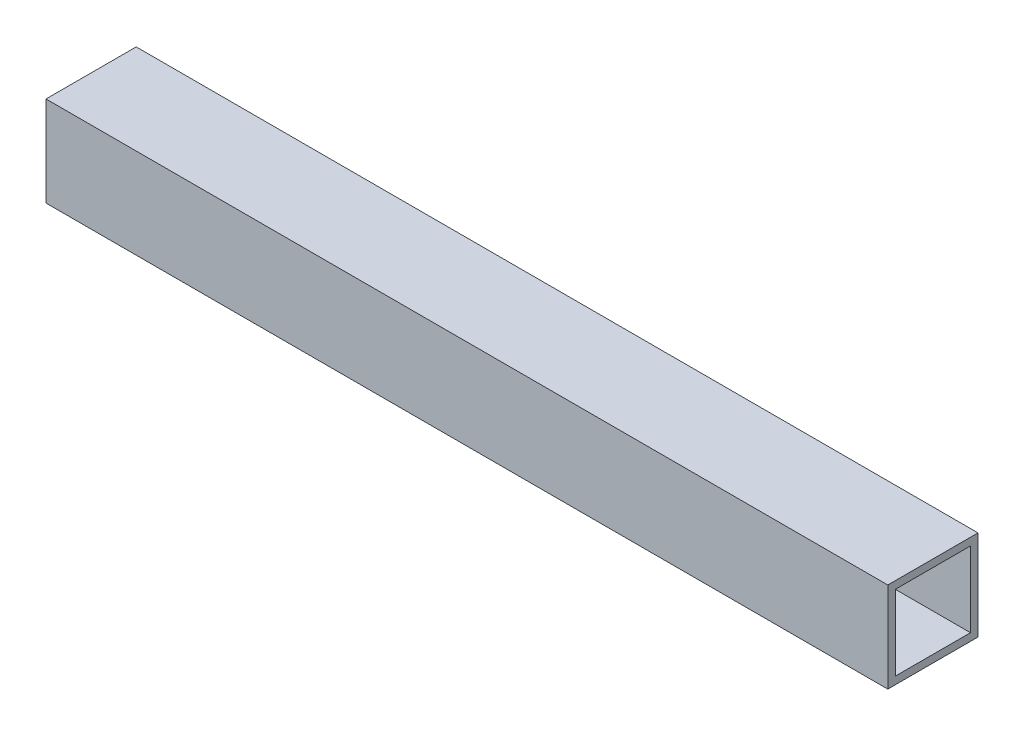
ISO-10303-21;
HEADER;
FILE_DESCRIPTION(('STEP AP214'),'2;1');
FILE_NAME('part.step','',(''),(''),'','','');
FILE_SCHEMA(('AUTOMOTIVE_DESIGN { 1 0 10303 214 1 1 1 1 }'));
ENDSEC;
DATA;
#1=APPLICATION_CONTEXT('core data for automotive mechanical design processes');
#2=APPLICATION_PROTOCOL_DEFINITION('international standard','automotive_design',2000,#1);
#3=PRODUCT_CONTEXT('',#1,'mechanical');
#4=PRODUCT('Part','Part','',(#3));
#5=PRODUCT_RELATED_PRODUCT_CATEGORY('part','',(#4));
#6=PRODUCT_DEFINITION_FORMATION('','',#4);
#7=PRODUCT_DEFINITION_CONTEXT('part definition',#1,'design');
#8=PRODUCT_DEFINITION('design','',#6,#7);
#9=PRODUCT_DEFINITION_SHAPE('','',#8);
#10=(LENGTH_UNIT() NAMED_UNIT(*) SI_UNIT(.MILLI.,.METRE.));
#11=(NAMED_UNIT(*) PLANE_ANGLE_UNIT() SI_UNIT($,.RADIAN.));
#12=(NAMED_UNIT(*) SI_UNIT($,.STERADIAN.) SOLID_ANGLE_UNIT());
#13=UNCERTAINTY_MEASURE_WITH_UNIT(LENGTH_MEASURE(1.E-05),#10,'distance_accuracy_value','');
#14=(GEOMETRIC_REPRESENTATION_CONTEXT(3) GLOBAL_UNCERTAINTY_ASSIGNED_CONTEXT((#13)) GLOBAL_UNIT_ASSIGNED_CONTEXT((#10,
#11,#12)) REPRESENTATION_CONTEXT('',''));
#15=CARTESIAN_POINT('',(0.,0.,0.));
#16=DIRECTION('',(0.,0.,1.));
#17=DIRECTION('',(1.,0.,0.));
#18=AXIS2_PLACEMENT_3D('',#15,#16,#17);
#19=CARTESIAN_POINT('',(88.9,0.,0.));
#20=DIRECTION('',(1.,0.,0.));
#21=DIRECTION('',(0.,0.,-1.));
#22=AXIS2_PLACEMENT_3D('',#19,#20,#21);
#23=PLANE('',#22);
#24=DIRECTION('',(0.,0.,-1.));
#25=VECTOR('',#24,1.);
#26=CARTESIAN_POINT('',(88.9,-9.525,-9.525));
#27=LINE('',#26,#25);
#28=CARTESIAN_POINT('',(88.9,-9.525,9.525));
#29=VERTEX_POINT('',#28);
#30=CARTESIAN_POINT('',(88.9,-9.525,-9.525));
#31=VERTEX_POINT('',#30);
#32=EDGE_CURVE('E136',#29,#31,#27,.T.);
#33=ORIENTED_EDGE('',*,*,#32,.T.);
#34=DIRECTION('',(0.,1.,0.));
#35=VECTOR('',#34,1.);
#36=CARTESIAN_POINT('',(88.9,9.525,-9.525));
#37=LINE('',#36,#35);
#38=CARTESIAN_POINT('',(88.9,9.525,-9.525));
#39=VERTEX_POINT('',#38);
#40=EDGE_CURVE('E139',#31,#39,#37,.T.);
#41=ORIENTED_EDGE('',*,*,#40,.T.);
#42=DIRECTION('',(0.,0.,1.));
#43=VECTOR('',#42,1.);
#44=CARTESIAN_POINT('',(88.9,9.525,-9.525));
#45=LINE('',#44,#43);
#46=CARTESIAN_POINT('',(88.9,9.525,9.525));
#47=VERTEX_POINT('',#46);
#48=EDGE_CURVE('E142',#39,#47,#45,.T.);
#49=ORIENTED_EDGE('',*,*,#48,.T.);
#50=DIRECTION('',(0.,-1.,0.));
#51=VECTOR('',#50,1.);
#52=CARTESIAN_POINT('',(88.9,9.525,9.525));
#53=LINE('',#52,#51);
#54=EDGE_CURVE('E144',#47,#29,#53,.T.);
#55=ORIENTED_EDGE('',*,*,#54,.T.);
#56=EDGE_LOOP('',(#33,#41,#49,#55));
#57=FACE_BOUND('',#56,.T.);
#58=DIRECTION('',(0.,1.,0.));
#59=VECTOR('',#58,1.);
#60=CARTESIAN_POINT('',(88.9,7.9375,-7.9375));
#61=LINE('',#60,#59);
#62=CARTESIAN_POINT('',(88.9,-7.9375,-7.9375));
#63=VERTEX_POINT('',#62);
#64=CARTESIAN_POINT('',(88.9,7.9375,-7.9375));
#65=VERTEX_POINT('',#64);
#66=EDGE_CURVE('E108',#63,#65,#61,.T.);
#67=ORIENTED_EDGE('',*,*,#66,.F.);
#68=DIRECTION('',(0.,0.,-1.));
#69=VECTOR('',#68,1.);
#70=CARTESIAN_POINT('',(88.9,-7.9375,-7.9375));
#71=LINE('',#70,#69);
#72=CARTESIAN_POINT('',(88.9,-7.9375,7.9375));
#73=VERTEX_POINT('',#72);
#74=EDGE_CURVE('E100',#73,#63,#71,.T.);
#75=ORIENTED_EDGE('',*,*,#74,.F.);
#76=DIRECTION('',(0.,-1.,0.));
#77=VECTOR('',#76,1.);
#78=CARTESIAN_POINT('',(88.9,7.9375,7.9375));
#79=LINE('',#78,#77);
#80=CARTESIAN_POINT('',(88.9,7.9375,7.9375));
#81=VERTEX_POINT('',#80);
#82=EDGE_CURVE('E122',#81,#73,#79,.T.);
#83=ORIENTED_EDGE('',*,*,#82,.F.);
#84=DIRECTION('',(0.,0.,1.));
#85=VECTOR('',#84,1.);
#86=CARTESIAN_POINT('',(88.9,7.9375,-7.9375));
#87=LINE('',#86,#85);
#88=EDGE_CURVE('E120',#65,#81,#87,.T.);
#89=ORIENTED_EDGE('',*,*,#88,.F.);
#90=EDGE_LOOP('',(#67,#75,#83,#89));
#91=FACE_BOUND('',#90,.T.);
#92=ADVANCED_FACE('F35',(#57,#91),#23,.T.);
#93=CARTESIAN_POINT('',(-88.9,0.,0.));
#94=DIRECTION('',(1.,0.,0.));
#95=DIRECTION('',(0.,0.,-1.));
#96=AXIS2_PLACEMENT_3D('',#93,#94,#95);
#97=PLANE('',#96);
#98=DIRECTION('',(0.,0.,-1.));
#99=VECTOR('',#98,1.);
#100=CARTESIAN_POINT('',(-88.9,-9.525,-9.525));
#101=LINE('',#100,#99);
#102=CARTESIAN_POINT('',(-88.9,-9.525,9.525));
#103=VERTEX_POINT('',#102);
#104=CARTESIAN_POINT('',(-88.9,-9.525,-9.525));
#105=VERTEX_POINT('',#104);
#106=EDGE_CURVE('E116',#103,#105,#101,.T.);
#107=ORIENTED_EDGE('',*,*,#106,.F.);
#108=DIRECTION('',(0.,-1.,0.));
#109=VECTOR('',#108,1.);
#110=CARTESIAN_POINT('',(-88.9,9.525,9.525));
#111=LINE('',#110,#109);
#112=CARTESIAN_POINT('',(-88.9,9.525,9.525));
#113=VERTEX_POINT('',#112);
#114=EDGE_CURVE('E140',#113,#103,#111,.T.);
#115=ORIENTED_EDGE('',*,*,#114,.F.);
#116=DIRECTION('',(0.,0.,1.));
#117=VECTOR('',#116,1.);
#118=CARTESIAN_POINT('',(-88.9,9.525,-9.525));
#119=LINE('',#118,#117);
#120=CARTESIAN_POINT('',(-88.9,9.525,-9.525));
#121=VERTEX_POINT('',#120);
#122=EDGE_CURVE('E151',#121,#113,#119,.T.);
#123=ORIENTED_EDGE('',*,*,#122,.F.);
#124=DIRECTION('',(0.,1.,0.));
#125=VECTOR('',#124,1.);
#126=CARTESIAN_POINT('',(-88.9,9.525,-9.525));
#127=LINE('',#126,#125);
#128=EDGE_CURVE('E149',#105,#121,#127,.T.);
#129=ORIENTED_EDGE('',*,*,#128,.F.);
#130=EDGE_LOOP('',(#107,#115,#123,#129));
#131=FACE_BOUND('',#130,.T.);
#132=DIRECTION('',(0.,0.,-1.));
#133=VECTOR('',#132,1.);
#134=CARTESIAN_POINT('',(-88.9,-7.9375,-7.9375));
#135=LINE('',#134,#133);
#136=CARTESIAN_POINT('',(-88.9,-7.9375,7.9375));
#137=VERTEX_POINT('',#136);
#138=CARTESIAN_POINT('',(-88.9,-7.9375,-7.9375));
#139=VERTEX_POINT('',#138);
#140=EDGE_CURVE('E58',#137,#139,#135,.T.);
#141=ORIENTED_EDGE('',*,*,#140,.T.);
#142=DIRECTION('',(0.,1.,0.));
#143=VECTOR('',#142,1.);
#144=CARTESIAN_POINT('',(-88.9,7.9375,-7.9375));
#145=LINE('',#144,#143);
#146=CARTESIAN_POINT('',(-88.9,7.9375,-7.9375));
#147=VERTEX_POINT('',#146);
#148=EDGE_CURVE('E115',#139,#147,#145,.T.);
#149=ORIENTED_EDGE('',*,*,#148,.T.);
#150=DIRECTION('',(0.,0.,1.));
#151=VECTOR('',#150,1.);
#152=CARTESIAN_POINT('',(-88.9,7.9375,-7.9375));
#153=LINE('',#152,#151);
#154=CARTESIAN_POINT('',(-88.9,7.9375,7.9375));
#155=VERTEX_POINT('',#154);
#156=EDGE_CURVE('E128',#147,#155,#153,.T.);
#157=ORIENTED_EDGE('',*,*,#156,.T.);
#158=DIRECTION('',(0.,-1.,0.));
#159=VECTOR('',#158,1.);
#160=CARTESIAN_POINT('',(-88.9,7.9375,7.9375));
#161=LINE('',#160,#159);
#162=EDGE_CURVE('E109',#155,#137,#161,.T.);
#163=ORIENTED_EDGE('',*,*,#162,.T.);
#164=EDGE_LOOP('',(#141,#149,#157,#163));
#165=FACE_BOUND('',#164,.T.);
#166=ADVANCED_FACE('F169',(#131,#165),#97,.F.);
#167=CARTESIAN_POINT('',(88.9,-9.525,-9.525));
#168=DIRECTION('',(0.,1.,0.));
#169=DIRECTION('',(0.,0.,1.));
#170=AXIS2_PLACEMENT_3D('',#167,#168,#169);
#171=PLANE('',#170);
#172=ORIENTED_EDGE('',*,*,#106,.T.);
#173=DIRECTION('',(-1.,0.,0.));
#174=VECTOR('',#173,1.);
#175=CARTESIAN_POINT('',(88.9,-9.525,-9.525));
#176=LINE('',#175,#174);
#177=EDGE_CURVE('E11',#31,#105,#176,.T.);
#178=ORIENTED_EDGE('',*,*,#177,.F.);
#179=ORIENTED_EDGE('',*,*,#32,.F.);
#180=DIRECTION('',(-1.,0.,0.));
#181=VECTOR('',#180,1.);
#182=CARTESIAN_POINT('',(88.9,-9.525,9.525));
#183=LINE('',#182,#181);
#184=EDGE_CURVE('E146',#29,#103,#183,.T.);
#185=ORIENTED_EDGE('',*,*,#184,.T.);
#186=EDGE_LOOP('',(#172,#178,#179,#185));
#187=FACE_BOUND('',#186,.T.);
#188=ADVANCED_FACE('F37',(#187),#171,.F.);
#189=CARTESIAN_POINT('',(88.9,9.525,-9.525));
#190=DIRECTION('',(0.,0.,1.));
#191=DIRECTION('',(1.,0.,0.));
#192=AXIS2_PLACEMENT_3D('',#189,#190,#191);
#193=PLANE('',#192);
#194=ORIENTED_EDGE('',*,*,#128,.T.);
#195=DIRECTION('',(-1.,0.,0.));
#196=VECTOR('',#195,1.);
#197=CARTESIAN_POINT('',(88.9,9.525,-9.525));
#198=LINE('',#197,#196);
#199=EDGE_CURVE('E43',#39,#121,#198,.T.);
#200=ORIENTED_EDGE('',*,*,#199,.F.);
#201=ORIENTED_EDGE('',*,*,#40,.F.);
#202=ORIENTED_EDGE('',*,*,#177,.T.);
#203=EDGE_LOOP('',(#194,#200,#201,#202));
#204=FACE_BOUND('',#203,.T.);
#205=ADVANCED_FACE('F179',(#204),#193,.F.);
#206=CARTESIAN_POINT('',(88.9,9.525,-9.525));
#207=DIRECTION('',(0.,-1.,0.));
#208=DIRECTION('',(0.,0.,-1.));
#209=AXIS2_PLACEMENT_3D('',#206,#207,#208);
#210=PLANE('',#209);
#211=ORIENTED_EDGE('',*,*,#122,.T.);
#212=DIRECTION('',(-1.,0.,0.));
#213=VECTOR('',#212,1.);
#214=CARTESIAN_POINT('',(88.9,9.525,9.525));
#215=LINE('',#214,#213);
#216=EDGE_CURVE('E156',#47,#113,#215,.T.);
#217=ORIENTED_EDGE('',*,*,#216,.F.);
#218=ORIENTED_EDGE('',*,*,#48,.F.);
#219=ORIENTED_EDGE('',*,*,#199,.T.);
#220=EDGE_LOOP('',(#211,#217,#218,#219));
#221=FACE_BOUND('',#220,.T.);
#222=ADVANCED_FACE('F163',(#221),#210,.F.);
#223=CARTESIAN_POINT('',(88.9,9.525,9.525));
#224=DIRECTION('',(0.,0.,-1.));
#225=DIRECTION('',(-1.,0.,0.));
#226=AXIS2_PLACEMENT_3D('',#223,#224,#225);
#227=PLANE('',#226);
#228=ORIENTED_EDGE('',*,*,#114,.T.);
#229=ORIENTED_EDGE('',*,*,#184,.F.);
#230=ORIENTED_EDGE('',*,*,#54,.F.);
#231=ORIENTED_EDGE('',*,*,#216,.T.);
#232=EDGE_LOOP('',(#228,#229,#230,#231));
#233=FACE_BOUND('',#232,.T.);
#234=ADVANCED_FACE('F173',(#233),#227,.F.);
#235=CARTESIAN_POINT('',(88.9,-7.9375,-7.9375));
#236=DIRECTION('',(0.,1.,0.));
#237=DIRECTION('',(0.,0.,1.));
#238=AXIS2_PLACEMENT_3D('',#235,#236,#237);
#239=PLANE('',#238);
#240=ORIENTED_EDGE('',*,*,#140,.F.);
#241=DIRECTION('',(-1.,0.,0.));
#242=VECTOR('',#241,1.);
#243=CARTESIAN_POINT('',(88.9,-7.9375,7.9375));
#244=LINE('',#243,#242);
#245=EDGE_CURVE('E104',#73,#137,#244,.T.);
#246=ORIENTED_EDGE('',*,*,#245,.F.);
#247=ORIENTED_EDGE('',*,*,#74,.T.);
#248=DIRECTION('',(-1.,0.,0.));
#249=VECTOR('',#248,1.);
#250=CARTESIAN_POINT('',(88.9,-7.9375,-7.9375));
#251=LINE('',#250,#249);
#252=EDGE_CURVE('E103',#63,#139,#251,.T.);
#253=ORIENTED_EDGE('',*,*,#252,.T.);
#254=EDGE_LOOP('',(#240,#246,#247,#253));
#255=FACE_BOUND('',#254,.T.);
#256=ADVANCED_FACE('F102',(#255),#239,.T.);
#257=CARTESIAN_POINT('',(88.9,7.9375,-7.9375));
#258=DIRECTION('',(0.,0.,1.));
#259=DIRECTION('',(1.,0.,0.));
#260=AXIS2_PLACEMENT_3D('',#257,#258,#259);
#261=PLANE('',#260);
#262=ORIENTED_EDGE('',*,*,#148,.F.);
#263=ORIENTED_EDGE('',*,*,#252,.F.);
#264=ORIENTED_EDGE('',*,*,#66,.T.);
#265=DIRECTION('',(-1.,0.,0.));
#266=VECTOR('',#265,1.);
#267=CARTESIAN_POINT('',(88.9,7.9375,-7.9375));
#268=LINE('',#267,#266);
#269=EDGE_CURVE('E117',#65,#147,#268,.T.);
#270=ORIENTED_EDGE('',*,*,#269,.T.);
#271=EDGE_LOOP('',(#262,#263,#264,#270));
#272=FACE_BOUND('',#271,.T.);
#273=ADVANCED_FACE('F112',(#272),#261,.T.);
#274=CARTESIAN_POINT('',(88.9,7.9375,-7.9375));
#275=DIRECTION('',(0.,-1.,0.));
#276=DIRECTION('',(0.,0.,-1.));
#277=AXIS2_PLACEMENT_3D('',#274,#275,#276);
#278=PLANE('',#277);
#279=ORIENTED_EDGE('',*,*,#156,.F.);
#280=ORIENTED_EDGE('',*,*,#269,.F.);
#281=ORIENTED_EDGE('',*,*,#88,.T.);
#282=DIRECTION('',(-1.,0.,0.));
#283=VECTOR('',#282,1.);
#284=CARTESIAN_POINT('',(88.9,7.9375,7.9375));
#285=LINE('',#284,#283);
#286=EDGE_CURVE('E50',#81,#155,#285,.T.);
#287=ORIENTED_EDGE('',*,*,#286,.T.);
#288=EDGE_LOOP('',(#279,#280,#281,#287));
#289=FACE_BOUND('',#288,.T.);
#290=ADVANCED_FACE('F202',(#289),#278,.T.);
#291=CARTESIAN_POINT('',(88.9,7.9375,7.9375));
#292=DIRECTION('',(0.,0.,-1.));
#293=DIRECTION('',(-1.,0.,0.));
#294=AXIS2_PLACEMENT_3D('',#291,#292,#293);
#295=PLANE('',#294);
#296=ORIENTED_EDGE('',*,*,#162,.F.);
#297=ORIENTED_EDGE('',*,*,#286,.F.);
#298=ORIENTED_EDGE('',*,*,#82,.T.);
#299=ORIENTED_EDGE('',*,*,#245,.T.);
#300=EDGE_LOOP('',(#296,#297,#298,#299));
#301=FACE_BOUND('',#300,.T.);
#302=ADVANCED_FACE('F206',(#301),#295,.T.);
#303=CLOSED_SHELL('',(#92,#166,#188,#205,#222,#234,#256,#273,#290,#302));
#304=MANIFOLD_SOLID_BREP('B2',#303);
#305=ADVANCED_BREP_SHAPE_REPRESENTATION('',(#18,#304),#14);
#306=SHAPE_DEFINITION_REPRESENTATION(#9,#305);
ENDSEC;
END-ISO-10303-21;
